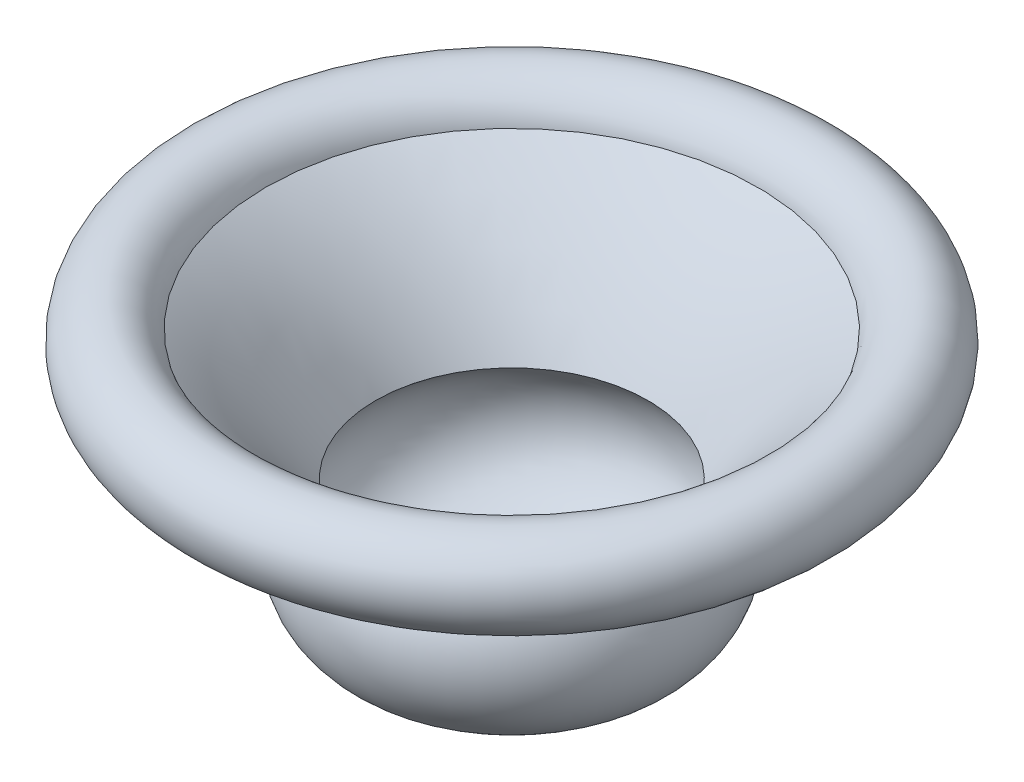
ISO-10303-21;
HEADER;
FILE_DESCRIPTION(('STEP AP214'),'2;1');
FILE_NAME('part.step','',(''),(''),'','','');
FILE_SCHEMA(('AUTOMOTIVE_DESIGN { 1 0 10303 214 1 1 1 1 }'));
ENDSEC;
DATA;
#1=APPLICATION_CONTEXT('core data for automotive mechanical design processes');
#2=APPLICATION_PROTOCOL_DEFINITION('international standard','automotive_design',2000,#1);
#3=PRODUCT_CONTEXT('',#1,'mechanical');
#4=PRODUCT('Part','Part','',(#3));
#5=PRODUCT_RELATED_PRODUCT_CATEGORY('part','',(#4));
#6=PRODUCT_DEFINITION_FORMATION('','',#4);
#7=PRODUCT_DEFINITION_CONTEXT('part definition',#1,'design');
#8=PRODUCT_DEFINITION('design','',#6,#7);
#9=PRODUCT_DEFINITION_SHAPE('','',#8);
#10=(LENGTH_UNIT() NAMED_UNIT(*) SI_UNIT(.MILLI.,.METRE.));
#11=(NAMED_UNIT(*) PLANE_ANGLE_UNIT() SI_UNIT($,.RADIAN.));
#12=(NAMED_UNIT(*) SI_UNIT($,.STERADIAN.) SOLID_ANGLE_UNIT());
#13=UNCERTAINTY_MEASURE_WITH_UNIT(LENGTH_MEASURE(1.E-05),#10,'distance_accuracy_value','');
#14=(GEOMETRIC_REPRESENTATION_CONTEXT(3) GLOBAL_UNCERTAINTY_ASSIGNED_CONTEXT((#13)) GLOBAL_UNIT_ASSIGNED_CONTEXT((#10,
#11,#12)) REPRESENTATION_CONTEXT('',''));
#15=CARTESIAN_POINT('',(0.,0.,0.));
#16=DIRECTION('',(0.,0.,1.));
#17=DIRECTION('',(1.,0.,0.));
#18=AXIS2_PLACEMENT_3D('',#15,#16,#17);
#19=CARTESIAN_POINT('',(0.,20.334140851359,0.));
#20=DIRECTION('',(0.,1.,0.));
#21=DIRECTION('',(-1.,0.,0.));
#22=AXIS2_PLACEMENT_3D('',#19,#20,#21);
#23=TOROIDAL_SURFACE('',#22,33.5396125667289,28.4212888847653);
#24=CARTESIAN_POINT('',(0.,40.2797634913916,0.));
#25=DIRECTION('',(0.,1.,0.));
#26=DIRECTION('',(-1.,0.,0.));
#27=AXIS2_PLACEMENT_3D('',#24,#25,#26);
#28=CIRCLE('',#27,53.7866320849867);
#29=CARTESIAN_POINT('',(-53.7866320849868,40.2797634913916,0.));
#30=VERTEX_POINT('',#29);
#31=EDGE_CURVE('E11',#30,#30,#28,.T.);
#32=ORIENTED_EDGE('',*,*,#31,.F.);
#33=EDGE_LOOP('',(#32));
#34=FACE_BOUND('',#33,.T.);
#35=CARTESIAN_POINT('',(0.,-7.26892934434773,0.));
#36=DIRECTION('',(0.,1.,0.));
#37=DIRECTION('',(-1.,0.,0.));
#38=AXIS2_PLACEMENT_3D('',#35,#36,#37);
#39=CIRCLE('',#38,26.7690750960275);
#40=CARTESIAN_POINT('',(-26.7690750960275,-7.26892934434774,0.));
#41=VERTEX_POINT('',#40);
#42=EDGE_CURVE('E94',#41,#41,#39,.T.);
#43=ORIENTED_EDGE('',*,*,#42,.T.);
#44=EDGE_LOOP('',(#43));
#45=FACE_BOUND('',#44,.T.);
#46=ADVANCED_FACE('F33',(#34,#45),#23,.T.);
#47=CARTESIAN_POINT('',(0.,-27.9040911673253,0.));
#48=DIRECTION('',(0.,1.,0.));
#49=DIRECTION('',(-1.,0.,0.));
#50=AXIS2_PLACEMENT_3D('',#47,#48,#49);
#51=TOROIDAL_SURFACE('',#50,172.643341501764,137.025382354896);
#52=CARTESIAN_POINT('',(0.,81.6239171393496,0.));
#53=DIRECTION('',(0.,1.,0.));
#54=DIRECTION('',(-1.,0.,0.));
#55=AXIS2_PLACEMENT_3D('',#52,#53,#54);
#56=CIRCLE('',#55,90.3051923491507);
#57=CARTESIAN_POINT('',(-90.3051923491508,81.6239171393496,0.));
#58=VERTEX_POINT('',#57);
#59=EDGE_CURVE('E40',#58,#58,#56,.T.);
#60=ORIENTED_EDGE('',*,*,#59,.F.);
#61=EDGE_LOOP('',(#60));
#62=FACE_BOUND('',#61,.T.);
#63=ORIENTED_EDGE('',*,*,#31,.T.);
#64=EDGE_LOOP('',(#63));
#65=FACE_BOUND('',#64,.T.);
#66=ADVANCED_FACE('F85',(#62,#65),#51,.F.);
#67=CARTESIAN_POINT('',(0.,80.7809752458086,0.));
#68=DIRECTION('',(0.,1.,0.));
#69=DIRECTION('',(-1.,0.,0.));
#70=AXIS2_PLACEMENT_3D('',#67,#68,#69);
#71=TOROIDAL_SURFACE('',#70,100.108819514528,9.83979962365111);
#72=CARTESIAN_POINT('',(0.,72.507752312718,0.));
#73=DIRECTION('',(0.,1.,0.));
#74=DIRECTION('',(-1.,0.,0.));
#75=AXIS2_PLACEMENT_3D('',#72,#73,#74);
#76=CIRCLE('',#75,105.435679652826);
#77=CARTESIAN_POINT('',(-105.435679652826,72.5077523127179,0.));
#78=VERTEX_POINT('',#77);
#79=EDGE_CURVE('E78',#78,#78,#76,.T.);
#80=ORIENTED_EDGE('',*,*,#79,.F.);
#81=EDGE_LOOP('',(#80));
#82=FACE_BOUND('',#81,.T.);
#83=ORIENTED_EDGE('',*,*,#59,.T.);
#84=EDGE_LOOP('',(#83));
#85=FACE_BOUND('',#84,.T.);
#86=ADVANCED_FACE('F83',(#82,#85),#71,.F.);
#87=CARTESIAN_POINT('',(0.,72.507752312718,0.));
#88=DIRECTION('',(0.,-1.,0.));
#89=DIRECTION('',(1.,0.,0.));
#90=AXIS2_PLACEMENT_3D('',#87,#88,#89);
#91=CONICAL_SURFACE('',#90,105.435679652826,0.572052126965431);
#92=CARTESIAN_POINT('',(0.,68.3037932639966,0.));
#93=DIRECTION('',(0.,1.,0.));
#94=DIRECTION('',(-1.,0.,0.));
#95=AXIS2_PLACEMENT_3D('',#92,#93,#94);
#96=CIRCLE('',#95,108.142472647621);
#97=CARTESIAN_POINT('',(-108.142472647621,68.3037932639966,0.));
#98=VERTEX_POINT('',#97);
#99=EDGE_CURVE('E75',#98,#98,#96,.T.);
#100=ORIENTED_EDGE('',*,*,#99,.F.);
#101=EDGE_LOOP('',(#100));
#102=FACE_BOUND('',#101,.T.);
#103=ORIENTED_EDGE('',*,*,#79,.T.);
#104=EDGE_LOOP('',(#103));
#105=FACE_BOUND('',#104,.T.);
#106=ADVANCED_FACE('F131',(#102,#105),#91,.F.);
#107=CARTESIAN_POINT('',(0.,80.7809752458086,0.));
#108=DIRECTION('',(0.,1.,0.));
#109=DIRECTION('',(-1.,0.,0.));
#110=AXIS2_PLACEMENT_3D('',#107,#108,#109);
#111=TOROIDAL_SURFACE('',#110,100.108819514528,14.8397996236512);
#112=CARTESIAN_POINT('',(0.,84.4156217611216,0.));
#113=DIRECTION('',(0.,1.,0.));
#114=DIRECTION('',(-1.,0.,0.));
#115=AXIS2_PLACEMENT_3D('',#112,#113,#114);
#116=CIRCLE('',#115,85.7210122605066);
#117=CARTESIAN_POINT('',(-85.7210122605066,84.4156217611216,0.));
#118=VERTEX_POINT('',#117);
#119=EDGE_CURVE('E72',#118,#118,#116,.T.);
#120=ORIENTED_EDGE('',*,*,#119,.F.);
#121=EDGE_LOOP('',(#120));
#122=FACE_BOUND('',#121,.T.);
#123=ORIENTED_EDGE('',*,*,#99,.T.);
#124=EDGE_LOOP('',(#123));
#125=FACE_BOUND('',#124,.T.);
#126=ADVANCED_FACE('F127',(#122,#125),#111,.T.);
#127=CARTESIAN_POINT('',(0.,-27.9040911673253,0.));
#128=DIRECTION('',(0.,1.,0.));
#129=DIRECTION('',(-1.,0.,0.));
#130=AXIS2_PLACEMENT_3D('',#127,#128,#129);
#131=TOROIDAL_SURFACE('',#130,172.643341501764,142.025382354896);
#132=CARTESIAN_POINT('',(0.,39.1727834019064,0.));
#133=DIRECTION('',(0.,1.,0.));
#134=DIRECTION('',(-1.,0.,0.));
#135=AXIS2_PLACEMENT_3D('',#132,#133,#134);
#136=CIRCLE('',#135,47.4558735543769);
#137=CARTESIAN_POINT('',(-47.4558735543769,39.1727834019064,0.));
#138=VERTEX_POINT('',#137);
#139=EDGE_CURVE('E69',#138,#138,#136,.T.);
#140=ORIENTED_EDGE('',*,*,#139,.F.);
#141=EDGE_LOOP('',(#140));
#142=FACE_BOUND('',#141,.T.);
#143=ORIENTED_EDGE('',*,*,#119,.T.);
#144=EDGE_LOOP('',(#143));
#145=FACE_BOUND('',#144,.T.);
#146=ADVANCED_FACE('F123',(#142,#145),#131,.T.);
#147=CARTESIAN_POINT('',(0.,20.334140851359,0.));
#148=DIRECTION('',(0.,1.,0.));
#149=DIRECTION('',(-1.,0.,0.));
#150=AXIS2_PLACEMENT_3D('',#147,#148,#149);
#151=TOROIDAL_SURFACE('',#150,33.5396125667289,23.4212888847653);
#152=CARTESIAN_POINT('',(0.,-2.41287402827394,0.));
#153=DIRECTION('',(0.,1.,0.));
#154=DIRECTION('',(-1.,0.,0.));
#155=AXIS2_PLACEMENT_3D('',#152,#153,#154);
#156=CIRCLE('',#155,27.9601782683982);
#157=CARTESIAN_POINT('',(-27.9601782683982,-2.41287402827394,0.));
#158=VERTEX_POINT('',#157);
#159=EDGE_CURVE('E60',#158,#158,#156,.T.);
#160=ORIENTED_EDGE('',*,*,#159,.F.);
#161=EDGE_LOOP('',(#160));
#162=FACE_BOUND('',#161,.T.);
#163=ORIENTED_EDGE('',*,*,#139,.T.);
#164=EDGE_LOOP('',(#163));
#165=FACE_BOUND('',#164,.T.);
#166=ADVANCED_FACE('F119',(#162,#165),#151,.F.);
#167=CARTESIAN_POINT('',(0.,-2.41287402827394,0.));
#168=DIRECTION('',(0.,-1.,0.));
#169=DIRECTION('',(1.,0.,0.));
#170=AXIS2_PLACEMENT_3D('',#167,#168,#169);
#171=CONICAL_SURFACE('',#170,27.9601782683982,1.5544658343014);
#172=CARTESIAN_POINT('',(0.,-2.26892934434774,0.));
#173=DIRECTION('',(0.,1.,0.));
#174=DIRECTION('',(-1.,0.,0.));
#175=AXIS2_PLACEMENT_3D('',#172,#173,#174);
#176=CIRCLE('',#175,19.1464889204454);
#177=CARTESIAN_POINT('',(-19.1464889204454,-2.26892934434774,0.));
#178=VERTEX_POINT('',#177);
#179=EDGE_CURVE('E56',#178,#178,#176,.T.);
#180=ORIENTED_EDGE('',*,*,#179,.F.);
#181=EDGE_LOOP('',(#180));
#182=FACE_BOUND('',#181,.T.);
#183=ORIENTED_EDGE('',*,*,#159,.T.);
#184=EDGE_LOOP('',(#183));
#185=FACE_BOUND('',#184,.T.);
#186=ADVANCED_FACE('F116',(#182,#185),#171,.T.);
#187=CARTESIAN_POINT('',(0.,2.73107065565227,0.));
#188=DIRECTION('',(0.,1.,0.));
#189=DIRECTION('',(-1.,0.,0.));
#190=AXIS2_PLACEMENT_3D('',#187,#188,#189);
#191=TOROIDAL_SURFACE('',#190,19.1464889204454,5.);
#192=CARTESIAN_POINT('',(0.,0.307471759981149,0.));
#193=DIRECTION('',(0.,1.,0.));
#194=DIRECTION('',(-1.,0.,0.));
#195=AXIS2_PLACEMENT_3D('',#192,#193,#194);
#196=CIRCLE('',#195,14.7731414161986);
#197=CARTESIAN_POINT('',(-14.7731414161986,0.307471759981147,0.));
#198=VERTEX_POINT('',#197);
#199=EDGE_CURVE('E54',#198,#198,#196,.T.);
#200=ORIENTED_EDGE('',*,*,#199,.F.);
#201=EDGE_LOOP('',(#200));
#202=FACE_BOUND('',#201,.T.);
#203=ORIENTED_EDGE('',*,*,#179,.T.);
#204=EDGE_LOOP('',(#203));
#205=FACE_BOUND('',#204,.T.);
#206=ADVANCED_FACE('F50',(#202,#205),#191,.F.);
#207=CARTESIAN_POINT('',(-0.13004585807838,-7.80736251500035,0.));
#208=DIRECTION('',(0.,0.,-1.));
#209=DIRECTION('',(-1.,0.,0.));
#210=AXIS2_PLACEMENT_3D('',#207,#208,#209);
#211=CIRCLE('',#210,16.7412897601903);
#212=TRIMMED_CURVE('',#211,(PARAMETER_VALUE(-1.57856437620056)),
(PARAMETER_VALUE(1.57856437620056)),.T.,.PARAMETER.);
#213=CARTESIAN_POINT('',(0.,-7.80736251500035,0.));
#214=DIRECTION('',(0.,1.,0.));
#215=AXIS1_PLACEMENT('',#213,#214);
#216=SURFACE_OF_REVOLUTION('',#212,#215);
#217=CARTESIAN_POINT('',(0.,8.93342214132476,0.));
#218=VERTEX_POINT('',#217);
#219=VERTEX_LOOP('',#218);
#220=FACE_BOUND('',#219,.T.);
#221=ORIENTED_EDGE('',*,*,#199,.T.);
#222=EDGE_LOOP('',(#221));
#223=FACE_BOUND('',#222,.T.);
#224=ADVANCED_FACE('F46',(#220,#223),#216,.T.);
#225=CARTESIAN_POINT('',(-0.13004585807838,-7.80736251500035,0.));
#226=DIRECTION('',(0.,0.,-1.));
#227=DIRECTION('',(-1.,0.,0.));
#228=AXIS2_PLACEMENT_3D('',#225,#226,#227);
#229=CIRCLE('',#228,11.7412897601903);
#230=TRIMMED_CURVE('',#229,(PARAMETER_VALUE(-1.581872496433)),(PARAMETER_VALUE(1.581872496433)),
.T.,.PARAMETER.);
#231=CARTESIAN_POINT('',(0.,-7.80736251500035,0.));
#232=DIRECTION('',(0.,1.,0.));
#233=AXIS1_PLACEMENT('',#231,#232);
#234=SURFACE_OF_REVOLUTION('',#230,#233);
#235=CARTESIAN_POINT('',(0.,-2.11612713568998,0.));
#236=DIRECTION('',(0.,1.,0.));
#237=DIRECTION('',(-1.,0.,0.));
#238=AXIS2_PLACEMENT_3D('',#235,#236,#237);
#239=CIRCLE('',#238,10.3997939119518);
#240=CARTESIAN_POINT('',(-10.3997939119518,-2.11612713568998,0.));
#241=VERTEX_POINT('',#240);
#242=EDGE_CURVE('E57',#241,#241,#239,.T.);
#243=ORIENTED_EDGE('',*,*,#242,.F.);
#244=EDGE_LOOP('',(#243));
#245=FACE_BOUND('',#244,.T.);
#246=CARTESIAN_POINT('',(0.,3.9332070328345,0.));
#247=VERTEX_POINT('',#246);
#248=VERTEX_LOOP('',#247);
#249=FACE_BOUND('',#248,.T.);
#250=ADVANCED_FACE('F49',(#245,#249),#234,.F.);
#251=CARTESIAN_POINT('',(0.,2.73107065565227,0.));
#252=DIRECTION('',(0.,1.,0.));
#253=DIRECTION('',(-1.,0.,0.));
#254=AXIS2_PLACEMENT_3D('',#251,#252,#253);
#255=TOROIDAL_SURFACE('',#254,19.1464889204454,10.);
#256=CARTESIAN_POINT('',(0.,-7.26892934434773,0.));
#257=DIRECTION('',(0.,1.,0.));
#258=DIRECTION('',(-1.,0.,0.));
#259=AXIS2_PLACEMENT_3D('',#256,#257,#258);
#260=CIRCLE('',#259,19.1464889204454);
#261=CARTESIAN_POINT('',(-19.1464889204454,-7.26892934434774,0.));
#262=VERTEX_POINT('',#261);
#263=EDGE_CURVE('E63',#262,#262,#260,.T.);
#264=ORIENTED_EDGE('',*,*,#263,.F.);
#265=EDGE_LOOP('',(#264));
#266=FACE_BOUND('',#265,.T.);
#267=ORIENTED_EDGE('',*,*,#242,.T.);
#268=EDGE_LOOP('',(#267));
#269=FACE_BOUND('',#268,.T.);
#270=ADVANCED_FACE('F102',(#266,#269),#255,.T.);
#271=CARTESIAN_POINT('',(26.7690750960275,-7.26892934434773,0.));
#272=DIRECTION('',(0.,1.,0.));
#273=DIRECTION('',(-1.,0.,0.));
#274=AXIS2_PLACEMENT_3D('',#271,#272,#273);
#275=PLANE('',#274);
#276=ORIENTED_EDGE('',*,*,#42,.F.);
#277=EDGE_LOOP('',(#276));
#278=FACE_BOUND('',#277,.T.);
#279=ORIENTED_EDGE('',*,*,#263,.T.);
#280=EDGE_LOOP('',(#279));
#281=FACE_BOUND('',#280,.T.);
#282=ADVANCED_FACE('F100',(#278,#281),#275,.F.);
#283=CLOSED_SHELL('',(#46,#66,#86,#106,#126,#146,#166,#186,#206,#224,#250,#270,#282));
#284=MANIFOLD_SOLID_BREP('B2',#283);
#285=ADVANCED_BREP_SHAPE_REPRESENTATION('',(#18,#284),#14);
#286=SHAPE_DEFINITION_REPRESENTATION(#9,#285);
ENDSEC;
END-ISO-10303-21;
